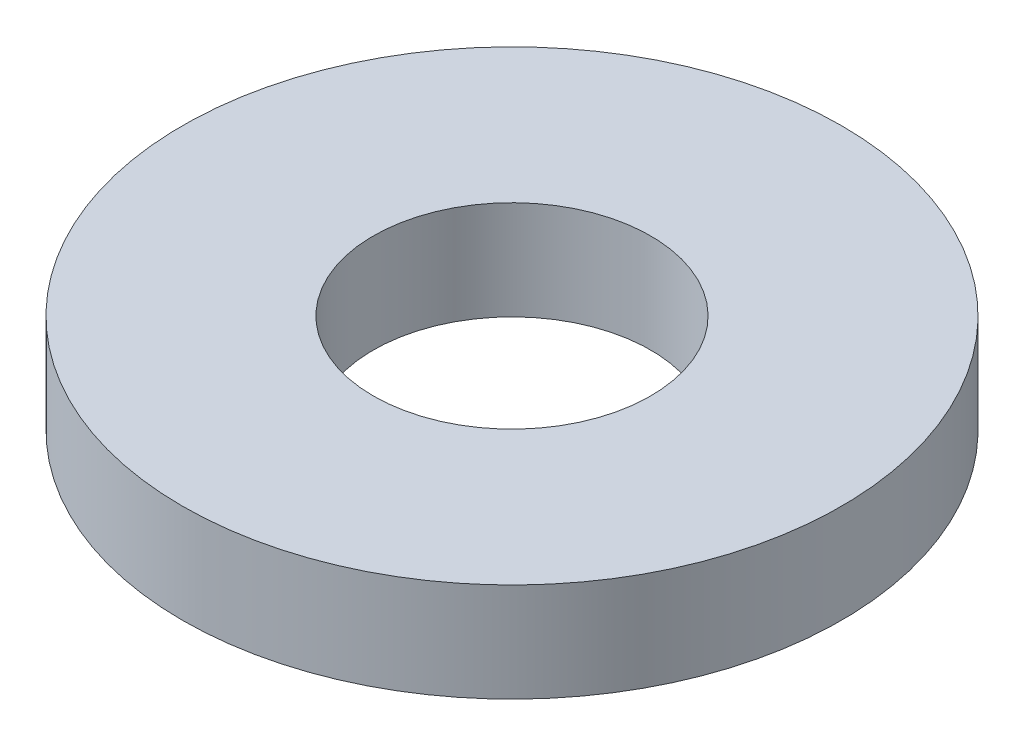
ISO-10303-21;
HEADER;
FILE_DESCRIPTION(('STEP AP214'),'2;1');
FILE_NAME('part.step','',(''),(''),'','','');
FILE_SCHEMA(('AUTOMOTIVE_DESIGN { 1 0 10303 214 1 1 1 1 }'));
ENDSEC;
DATA;
#1=APPLICATION_CONTEXT('core data for automotive mechanical design processes');
#2=APPLICATION_PROTOCOL_DEFINITION('international standard','automotive_design',2000,#1);
#3=PRODUCT_CONTEXT('',#1,'mechanical');
#4=PRODUCT('Part','Part','',(#3));
#5=PRODUCT_RELATED_PRODUCT_CATEGORY('part','',(#4));
#6=PRODUCT_DEFINITION_FORMATION('','',#4);
#7=PRODUCT_DEFINITION_CONTEXT('part definition',#1,'design');
#8=PRODUCT_DEFINITION('design','',#6,#7);
#9=PRODUCT_DEFINITION_SHAPE('','',#8);
#10=(LENGTH_UNIT() NAMED_UNIT(*) SI_UNIT(.MILLI.,.METRE.));
#11=(NAMED_UNIT(*) PLANE_ANGLE_UNIT() SI_UNIT($,.RADIAN.));
#12=(NAMED_UNIT(*) SI_UNIT($,.STERADIAN.) SOLID_ANGLE_UNIT());
#13=UNCERTAINTY_MEASURE_WITH_UNIT(LENGTH_MEASURE(1.E-05),#10,'distance_accuracy_value','');
#14=(GEOMETRIC_REPRESENTATION_CONTEXT(3) GLOBAL_UNCERTAINTY_ASSIGNED_CONTEXT((#13)) GLOBAL_UNIT_ASSIGNED_CONTEXT((#10,
#11,#12)) REPRESENTATION_CONTEXT('',''));
#15=CARTESIAN_POINT('',(0.,0.,0.));
#16=DIRECTION('',(0.,0.,1.));
#17=DIRECTION('',(1.,0.,0.));
#18=AXIS2_PLACEMENT_3D('',#15,#16,#17);
#19=CARTESIAN_POINT('',(0.,-4.7625,0.));
#20=DIRECTION('',(0.,1.,0.));
#21=DIRECTION('',(0.,0.,1.));
#22=AXIS2_PLACEMENT_3D('',#19,#20,#21);
#23=CYLINDRICAL_SURFACE('',#22,15.875);
#24=CARTESIAN_POINT('',(0.,-4.7625,0.));
#25=DIRECTION('',(0.,1.,0.));
#26=DIRECTION('',(0.,0.,1.));
#27=AXIS2_PLACEMENT_3D('',#24,#25,#26);
#28=CIRCLE('',#27,15.875);
#29=CARTESIAN_POINT('',(0.,-4.7625,15.875));
#30=VERTEX_POINT('',#29);
#31=EDGE_CURVE('E10',#30,#30,#28,.T.);
#32=ORIENTED_EDGE('',*,*,#31,.T.);
#33=EDGE_LOOP('',(#32));
#34=FACE_BOUND('',#33,.T.);
#35=CARTESIAN_POINT('',(0.,0.,0.));
#36=DIRECTION('',(0.,1.,0.));
#37=DIRECTION('',(0.,0.,1.));
#38=AXIS2_PLACEMENT_3D('',#35,#36,#37);
#39=CIRCLE('',#38,15.875);
#40=CARTESIAN_POINT('',(0.,0.,15.875));
#41=VERTEX_POINT('',#40);
#42=EDGE_CURVE('E364',#41,#41,#39,.T.);
#43=ORIENTED_EDGE('',*,*,#42,.F.);
#44=EDGE_LOOP('',(#43));
#45=FACE_BOUND('',#44,.T.);
#46=ADVANCED_FACE('F358',(#34,#45),#23,.T.);
#47=CARTESIAN_POINT('',(0.,-4.7625,0.));
#48=DIRECTION('',(0.,1.,0.));
#49=DIRECTION('',(0.,0.,1.));
#50=AXIS2_PLACEMENT_3D('',#47,#48,#49);
#51=PLANE('',#50);
#52=CARTESIAN_POINT('',(0.,-4.7625,0.));
#53=DIRECTION('',(0.,1.,0.));
#54=DIRECTION('',(0.,0.,1.));
#55=AXIS2_PLACEMENT_3D('',#52,#53,#54);
#56=CIRCLE('',#55,6.6802);
#57=CARTESIAN_POINT('',(0.,-4.7625,6.6802));
#58=VERTEX_POINT('',#57);
#59=EDGE_CURVE('E368',#58,#58,#56,.T.);
#60=ORIENTED_EDGE('',*,*,#59,.T.);
#61=EDGE_LOOP('',(#60));
#62=FACE_BOUND('',#61,.T.);
#63=ORIENTED_EDGE('',*,*,#31,.F.);
#64=EDGE_LOOP('',(#63));
#65=FACE_BOUND('',#64,.T.);
#66=ADVANCED_FACE('F382',(#62,#65),#51,.F.);
#67=CARTESIAN_POINT('',(0.,0.,0.));
#68=DIRECTION('',(0.,1.,0.));
#69=DIRECTION('',(0.,0.,1.));
#70=AXIS2_PLACEMENT_3D('',#67,#68,#69);
#71=PLANE('',#70);
#72=CARTESIAN_POINT('',(0.,0.,0.));
#73=DIRECTION('',(0.,1.,0.));
#74=DIRECTION('',(0.,0.,1.));
#75=AXIS2_PLACEMENT_3D('',#72,#73,#74);
#76=CIRCLE('',#75,6.6802);
#77=CARTESIAN_POINT('',(0.,0.,6.6802));
#78=VERTEX_POINT('',#77);
#79=EDGE_CURVE('E372',#78,#78,#76,.T.);
#80=ORIENTED_EDGE('',*,*,#79,.F.);
#81=EDGE_LOOP('',(#80));
#82=FACE_BOUND('',#81,.T.);
#83=ORIENTED_EDGE('',*,*,#42,.T.);
#84=EDGE_LOOP('',(#83));
#85=FACE_BOUND('',#84,.T.);
#86=ADVANCED_FACE('F380',(#82,#85),#71,.T.);
#87=CARTESIAN_POINT('',(0.,-4.7625,0.));
#88=DIRECTION('',(0.,1.,0.));
#89=DIRECTION('',(0.,0.,1.));
#90=AXIS2_PLACEMENT_3D('',#87,#88,#89);
#91=CYLINDRICAL_SURFACE('',#90,6.6802);
#92=ORIENTED_EDGE('',*,*,#59,.F.);
#93=EDGE_LOOP('',(#92));
#94=FACE_BOUND('',#93,.T.);
#95=ORIENTED_EDGE('',*,*,#79,.T.);
#96=EDGE_LOOP('',(#95));
#97=FACE_BOUND('',#96,.T.);
#98=ADVANCED_FACE('F378',(#94,#97),#91,.F.);
#99=CLOSED_SHELL('',(#46,#66,#86,#98));
#100=MANIFOLD_SOLID_BREP('B2',#99);
#101=ADVANCED_BREP_SHAPE_REPRESENTATION('',(#18,#100),#14);
#102=SHAPE_DEFINITION_REPRESENTATION(#9,#101);
ENDSEC;
END-ISO-10303-21;
